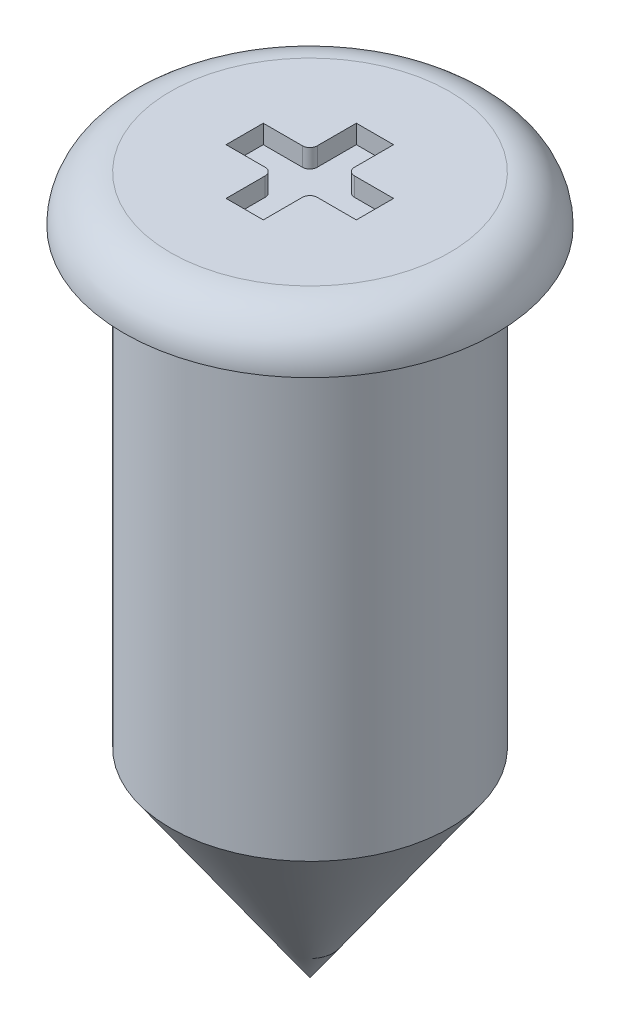
ISO-10303-21;
HEADER;
FILE_DESCRIPTION(('STEP AP214'),'2;1');
FILE_NAME('part.step','',(''),(''),'','','');
FILE_SCHEMA(('AUTOMOTIVE_DESIGN { 1 0 10303 214 1 1 1 1 }'));
ENDSEC;
DATA;
#1=APPLICATION_CONTEXT('core data for automotive mechanical design processes');
#2=APPLICATION_PROTOCOL_DEFINITION('international standard','automotive_design',2000,#1);
#3=PRODUCT_CONTEXT('',#1,'mechanical');
#4=PRODUCT('Part','Part','',(#3));
#5=PRODUCT_RELATED_PRODUCT_CATEGORY('part','',(#4));
#6=PRODUCT_DEFINITION_FORMATION('','',#4);
#7=PRODUCT_DEFINITION_CONTEXT('part definition',#1,'design');
#8=PRODUCT_DEFINITION('design','',#6,#7);
#9=PRODUCT_DEFINITION_SHAPE('','',#8);
#10=(LENGTH_UNIT() NAMED_UNIT(*) SI_UNIT(.MILLI.,.METRE.));
#11=(NAMED_UNIT(*) PLANE_ANGLE_UNIT() SI_UNIT($,.RADIAN.));
#12=(NAMED_UNIT(*) SI_UNIT($,.STERADIAN.) SOLID_ANGLE_UNIT());
#13=UNCERTAINTY_MEASURE_WITH_UNIT(LENGTH_MEASURE(1.E-05),#10,'distance_accuracy_value','');
#14=(GEOMETRIC_REPRESENTATION_CONTEXT(3) GLOBAL_UNCERTAINTY_ASSIGNED_CONTEXT((#13)) GLOBAL_UNIT_ASSIGNED_CONTEXT((#10,
#11,#12)) REPRESENTATION_CONTEXT('',''));
#15=CARTESIAN_POINT('',(0.,0.,0.));
#16=DIRECTION('',(0.,0.,1.));
#17=DIRECTION('',(1.,0.,0.));
#18=AXIS2_PLACEMENT_3D('',#15,#16,#17);
#19=CARTESIAN_POINT('',(0.,-14.4059764880595,0.));
#20=DIRECTION('',(0.,1.,0.));
#21=DIRECTION('',(0.,0.,1.));
#22=AXIS2_PLACEMENT_3D('',#19,#20,#21);
#23=CONICAL_SURFACE('',#22,0.,0.610177644580509);
#24=CARTESIAN_POINT('',(0.,-13.3332964313297,0.));
#25=DIRECTION('',(0.,1.,0.));
#26=DIRECTION('',(0.,0.,1.));
#27=AXIS2_PLACEMENT_3D('',#24,#25,#26);
#28=CIRCLE('',#27,0.75);
#29=CARTESIAN_POINT('',(0.,-13.3332964313297,0.75));
#30=VERTEX_POINT('',#29);
#31=EDGE_CURVE('E11',#30,#30,#28,.T.);
#32=ORIENTED_EDGE('',*,*,#31,.F.);
#33=EDGE_LOOP('',(#32));
#34=FACE_BOUND('',#33,.T.);
#35=CARTESIAN_POINT('',(0.,-14.4059764880595,0.));
#36=VERTEX_POINT('',#35);
#37=VERTEX_LOOP('',#36);
#38=FACE_BOUND('',#37,.T.);
#39=ADVANCED_FACE('F45',(#34,#38),#23,.T.);
#40=CARTESIAN_POINT('',(0.,-10.6559764880595,0.));
#41=DIRECTION('',(0.,1.,0.));
#42=DIRECTION('',(0.,0.,1.));
#43=AXIS2_PLACEMENT_3D('',#40,#41,#42);
#44=CYLINDRICAL_SURFACE('',#43,0.75);
#45=CARTESIAN_POINT('',(0.,-10.9059764880595,0.));
#46=DIRECTION('',(0.,1.,0.));
#47=DIRECTION('',(0.,0.,1.));
#48=AXIS2_PLACEMENT_3D('',#45,#46,#47);
#49=CIRCLE('',#48,0.75);
#50=CARTESIAN_POINT('',(0.,-10.9059764880595,0.75));
#51=VERTEX_POINT('',#50);
#52=EDGE_CURVE('E52',#51,#51,#49,.T.);
#53=ORIENTED_EDGE('',*,*,#52,.F.);
#54=EDGE_LOOP('',(#53));
#55=FACE_BOUND('',#54,.T.);
#56=ORIENTED_EDGE('',*,*,#31,.T.);
#57=EDGE_LOOP('',(#56));
#58=FACE_BOUND('',#57,.T.);
#59=ADVANCED_FACE('F301',(#55,#58),#44,.T.);
#60=CARTESIAN_POINT('',(0.75,-10.9059764880595,0.));
#61=DIRECTION('',(0.,1.,0.));
#62=DIRECTION('',(0.,0.,1.));
#63=AXIS2_PLACEMENT_3D('',#60,#61,#62);
#64=PLANE('',#63);
#65=CARTESIAN_POINT('',(0.,-10.9059764880595,0.));
#66=DIRECTION('',(0.,1.,0.));
#67=DIRECTION('',(0.,0.,1.));
#68=AXIS2_PLACEMENT_3D('',#65,#66,#67);
#69=CIRCLE('',#68,1.);
#70=CARTESIAN_POINT('',(0.,-10.9059764880595,1.));
#71=VERTEX_POINT('',#70);
#72=EDGE_CURVE('E294',#71,#71,#69,.T.);
#73=ORIENTED_EDGE('',*,*,#72,.F.);
#74=EDGE_LOOP('',(#73));
#75=FACE_BOUND('',#74,.T.);
#76=ORIENTED_EDGE('',*,*,#52,.T.);
#77=EDGE_LOOP('',(#76));
#78=FACE_BOUND('',#77,.T.);
#79=ADVANCED_FACE('F299',(#75,#78),#64,.F.);
#80=CARTESIAN_POINT('',(0.,-10.9059764880595,0.));
#81=DIRECTION('',(0.,1.,0.));
#82=DIRECTION('',(0.,0.,1.));
#83=AXIS2_PLACEMENT_3D('',#80,#81,#82);
#84=TOROIDAL_SURFACE('',#83,0.75,0.25);
#85=CARTESIAN_POINT('',(0.,-10.6559764880595,0.));
#86=DIRECTION('',(0.,1.,0.));
#87=DIRECTION('',(0.,0.,1.));
#88=AXIS2_PLACEMENT_3D('',#85,#86,#87);
#89=CIRCLE('',#88,0.75);
#90=CARTESIAN_POINT('',(0.,-10.6559764880595,0.75));
#91=VERTEX_POINT('',#90);
#92=EDGE_CURVE('E264',#91,#91,#89,.T.);
#93=ORIENTED_EDGE('',*,*,#92,.F.);
#94=EDGE_LOOP('',(#93));
#95=FACE_BOUND('',#94,.T.);
#96=ORIENTED_EDGE('',*,*,#72,.T.);
#97=EDGE_LOOP('',(#96));
#98=FACE_BOUND('',#97,.T.);
#99=ADVANCED_FACE('F320',(#95,#98),#84,.T.);
#100=CARTESIAN_POINT('',(0.75,-10.6559764880595,0.));
#101=DIRECTION('',(0.,-1.,0.));
#102=DIRECTION('',(0.,0.,-1.));
#103=AXIS2_PLACEMENT_3D('',#100,#101,#102);
#104=PLANE('',#103);
#105=DIRECTION('',(-1.,0.,0.));
#106=VECTOR('',#105,1.);
#107=CARTESIAN_POINT('',(-0.10270085440738,-10.6559764880595,-0.351707002554257));
#108=LINE('',#107,#106);
#109=CARTESIAN_POINT('',(0.0972991455926199,-10.6559764880595,-0.351707002554257));
#110=VERTEX_POINT('',#109);
#111=CARTESIAN_POINT('',(-0.10270085440738,-10.6559764880595,-0.351707002554257));
#112=VERTEX_POINT('',#111);
#113=EDGE_CURVE('E222',#110,#112,#108,.T.);
#114=ORIENTED_EDGE('',*,*,#113,.F.);
#115=DIRECTION('',(0.,0.,-1.));
#116=VECTOR('',#115,1.);
#117=CARTESIAN_POINT('',(0.0972991455926199,-10.6559764880595,-0.351707002554257));
#118=LINE('',#117,#116);
#119=CARTESIAN_POINT('',(0.0972991455926199,-10.6559764880595,-0.141707002554257));
#120=VERTEX_POINT('',#119);
#121=EDGE_CURVE('E59',#120,#110,#118,.T.);
#122=ORIENTED_EDGE('',*,*,#121,.F.);
#123=CARTESIAN_POINT('',(0.13729914559262,-10.6559764880595,-0.141707002554257));
#124=DIRECTION('',(0.,-1.,0.));
#125=DIRECTION('',(0.,0.,1.));
#126=AXIS2_PLACEMENT_3D('',#123,#124,#125);
#127=CIRCLE('',#126,0.04);
#128=CARTESIAN_POINT('',(0.13729914559262,-10.6559764880595,-0.101707002554257));
#129=VERTEX_POINT('',#128);
#130=EDGE_CURVE('E178',#129,#120,#127,.T.);
#131=ORIENTED_EDGE('',*,*,#130,.F.);
#132=DIRECTION('',(-1.,0.,0.));
#133=VECTOR('',#132,1.);
#134=CARTESIAN_POINT('',(0.13729914559262,-10.6559764880595,-0.101707002554257));
#135=LINE('',#134,#133);
#136=CARTESIAN_POINT('',(0.34729914559262,-10.6559764880595,-0.101707002554257));
#137=VERTEX_POINT('',#136);
#138=EDGE_CURVE('E181',#137,#129,#135,.T.);
#139=ORIENTED_EDGE('',*,*,#138,.F.);
#140=DIRECTION('',(0.,0.,-1.));
#141=VECTOR('',#140,1.);
#142=CARTESIAN_POINT('',(0.34729914559262,-10.6559764880595,-0.101707002554257));
#143=LINE('',#142,#141);
#144=CARTESIAN_POINT('',(0.34729914559262,-10.6559764880595,0.0982929974457434));
#145=VERTEX_POINT('',#144);
#146=EDGE_CURVE('E257',#145,#137,#143,.T.);
#147=ORIENTED_EDGE('',*,*,#146,.F.);
#148=DIRECTION('',(1.,0.,0.));
#149=VECTOR('',#148,1.);
#150=CARTESIAN_POINT('',(0.34729914559262,-10.6559764880595,0.0982929974457434));
#151=LINE('',#150,#149);
#152=CARTESIAN_POINT('',(0.13729914559262,-10.6559764880595,0.0982929974457434));
#153=VERTEX_POINT('',#152);
#154=EDGE_CURVE('E254',#153,#145,#151,.T.);
#155=ORIENTED_EDGE('',*,*,#154,.F.);
#156=CARTESIAN_POINT('',(0.13729914559262,-10.6559764880595,0.138292997445743));
#157=DIRECTION('',(0.,-1.,0.));
#158=DIRECTION('',(0.,0.,1.));
#159=AXIS2_PLACEMENT_3D('',#156,#157,#158);
#160=CIRCLE('',#159,0.04);
#161=CARTESIAN_POINT('',(0.09729914559262,-10.6559764880595,0.138292997445743));
#162=VERTEX_POINT('',#161);
#163=EDGE_CURVE('E251',#162,#153,#160,.T.);
#164=ORIENTED_EDGE('',*,*,#163,.F.);
#165=DIRECTION('',(0.,0.,-1.));
#166=VECTOR('',#165,1.);
#167=CARTESIAN_POINT('',(0.09729914559262,-10.6559764880595,0.138292997445743));
#168=LINE('',#167,#166);
#169=CARTESIAN_POINT('',(0.09729914559262,-10.6559764880595,0.348292997445743));
#170=VERTEX_POINT('',#169);
#171=EDGE_CURVE('E248',#170,#162,#168,.T.);
#172=ORIENTED_EDGE('',*,*,#171,.F.);
#173=DIRECTION('',(1.,0.,0.));
#174=VECTOR('',#173,1.);
#175=CARTESIAN_POINT('',(0.09729914559262,-10.6559764880595,0.348292997445743));
#176=LINE('',#175,#174);
#177=CARTESIAN_POINT('',(-0.10270085440738,-10.6559764880595,0.348292997445743));
#178=VERTEX_POINT('',#177);
#179=EDGE_CURVE('E245',#178,#170,#176,.T.);
#180=ORIENTED_EDGE('',*,*,#179,.F.);
#181=DIRECTION('',(0.,0.,1.));
#182=VECTOR('',#181,1.);
#183=CARTESIAN_POINT('',(-0.10270085440738,-10.6559764880595,0.138292997445743));
#184=LINE('',#183,#182);
#185=CARTESIAN_POINT('',(-0.10270085440738,-10.6559764880595,0.138292997445743));
#186=VERTEX_POINT('',#185);
#187=EDGE_CURVE('E242',#186,#178,#184,.T.);
#188=ORIENTED_EDGE('',*,*,#187,.F.);
#189=CARTESIAN_POINT('',(-0.14270085440738,-10.6559764880595,0.138292997445743));
#190=DIRECTION('',(0.,-1.,0.));
#191=DIRECTION('',(0.,0.,-1.));
#192=AXIS2_PLACEMENT_3D('',#189,#190,#191);
#193=CIRCLE('',#192,0.04);
#194=CARTESIAN_POINT('',(-0.14270085440738,-10.6559764880595,0.0982929974457434));
#195=VERTEX_POINT('',#194);
#196=EDGE_CURVE('E239',#195,#186,#193,.T.);
#197=ORIENTED_EDGE('',*,*,#196,.F.);
#198=DIRECTION('',(1.,0.,0.));
#199=VECTOR('',#198,1.);
#200=CARTESIAN_POINT('',(-0.35270085440738,-10.6559764880595,0.0982929974457434));
#201=LINE('',#200,#199);
#202=CARTESIAN_POINT('',(-0.35270085440738,-10.6559764880595,0.0982929974457434));
#203=VERTEX_POINT('',#202);
#204=EDGE_CURVE('E236',#203,#195,#201,.T.);
#205=ORIENTED_EDGE('',*,*,#204,.F.);
#206=DIRECTION('',(0.,0.,1.));
#207=VECTOR('',#206,1.);
#208=CARTESIAN_POINT('',(-0.35270085440738,-10.6559764880595,-0.101707002554257));
#209=LINE('',#208,#207);
#210=CARTESIAN_POINT('',(-0.35270085440738,-10.6559764880595,-0.101707002554257));
#211=VERTEX_POINT('',#210);
#212=EDGE_CURVE('E233',#211,#203,#209,.T.);
#213=ORIENTED_EDGE('',*,*,#212,.F.);
#214=DIRECTION('',(-1.,0.,0.));
#215=VECTOR('',#214,1.);
#216=CARTESIAN_POINT('',(-0.14270085440738,-10.6559764880595,-0.101707002554257));
#217=LINE('',#216,#215);
#218=CARTESIAN_POINT('',(-0.14270085440738,-10.6559764880595,-0.101707002554257));
#219=VERTEX_POINT('',#218);
#220=EDGE_CURVE('E230',#219,#211,#217,.T.);
#221=ORIENTED_EDGE('',*,*,#220,.F.);
#222=CARTESIAN_POINT('',(-0.14270085440738,-10.6559764880595,-0.141707002554257));
#223=DIRECTION('',(0.,-1.,0.));
#224=DIRECTION('',(0.,0.,-1.));
#225=AXIS2_PLACEMENT_3D('',#222,#223,#224);
#226=CIRCLE('',#225,0.04);
#227=CARTESIAN_POINT('',(-0.10270085440738,-10.6559764880595,-0.141707002554257));
#228=VERTEX_POINT('',#227);
#229=EDGE_CURVE('E227',#228,#219,#226,.T.);
#230=ORIENTED_EDGE('',*,*,#229,.F.);
#231=DIRECTION('',(0.,0.,1.));
#232=VECTOR('',#231,1.);
#233=CARTESIAN_POINT('',(-0.10270085440738,-10.6559764880595,-0.351707002554257));
#234=LINE('',#233,#232);
#235=EDGE_CURVE('E224',#112,#228,#234,.T.);
#236=ORIENTED_EDGE('',*,*,#235,.F.);
#237=EDGE_LOOP('',(#114,#122,#131,#139,#147,#155,#164,#172,#180,#188,#197,#205,#213,#221,#230,#236));
#238=FACE_BOUND('',#237,.T.);
#239=ORIENTED_EDGE('',*,*,#92,.T.);
#240=EDGE_LOOP('',(#239));
#241=FACE_BOUND('',#240,.T.);
#242=ADVANCED_FACE('F329',(#238,#241),#104,.F.);
#243=CARTESIAN_POINT('',(0.0972991455926199,-10.7559764880595,-0.351707002554257));
#244=DIRECTION('',(1.,0.,0.));
#245=DIRECTION('',(0.,0.,-1.));
#246=AXIS2_PLACEMENT_3D('',#243,#244,#245);
#247=PLANE('',#246);
#248=ORIENTED_EDGE('',*,*,#121,.T.);
#249=DIRECTION('',(0.,1.,0.));
#250=VECTOR('',#249,1.);
#251=CARTESIAN_POINT('',(0.0972991455926199,-10.7559764880595,-0.351707002554257));
#252=LINE('',#251,#250);
#253=CARTESIAN_POINT('',(0.0972991455926199,-10.7559764880595,-0.351707002554257));
#254=VERTEX_POINT('',#253);
#255=EDGE_CURVE('E155',#254,#110,#252,.T.);
#256=ORIENTED_EDGE('',*,*,#255,.F.);
#257=DIRECTION('',(0.,0.,-1.));
#258=VECTOR('',#257,1.);
#259=CARTESIAN_POINT('',(0.0972991455926199,-10.7559764880595,-0.351707002554257));
#260=LINE('',#259,#258);
#261=CARTESIAN_POINT('',(0.0972991455926199,-10.7559764880595,-0.141707002554257));
#262=VERTEX_POINT('',#261);
#263=EDGE_CURVE('E159',#262,#254,#260,.T.);
#264=ORIENTED_EDGE('',*,*,#263,.F.);
#265=DIRECTION('',(0.,1.,0.));
#266=VECTOR('',#265,1.);
#267=CARTESIAN_POINT('',(0.0972991455926199,-10.7559764880595,-0.141707002554257));
#268=LINE('',#267,#266);
#269=EDGE_CURVE('E262',#262,#120,#268,.T.);
#270=ORIENTED_EDGE('',*,*,#269,.T.);
#271=EDGE_LOOP('',(#248,#256,#264,#270));
#272=FACE_BOUND('',#271,.T.);
#273=ADVANCED_FACE('F157',(#272),#247,.F.);
#274=CARTESIAN_POINT('',(0.13729914559262,-10.7559764880595,-0.141707002554257));
#275=DIRECTION('',(0.,1.,0.));
#276=DIRECTION('',(0.,0.,1.));
#277=AXIS2_PLACEMENT_3D('',#274,#275,#276);
#278=CYLINDRICAL_SURFACE('',#277,0.04);
#279=ORIENTED_EDGE('',*,*,#130,.T.);
#280=ORIENTED_EDGE('',*,*,#269,.F.);
#281=CARTESIAN_POINT('',(0.13729914559262,-10.7559764880595,-0.141707002554257));
#282=DIRECTION('',(0.,-1.,0.));
#283=DIRECTION('',(0.,0.,1.));
#284=AXIS2_PLACEMENT_3D('',#281,#282,#283);
#285=CIRCLE('',#284,0.04);
#286=CARTESIAN_POINT('',(0.13729914559262,-10.7559764880595,-0.101707002554257));
#287=VERTEX_POINT('',#286);
#288=EDGE_CURVE('E165',#287,#262,#285,.T.);
#289=ORIENTED_EDGE('',*,*,#288,.F.);
#290=DIRECTION('',(0.,1.,0.));
#291=VECTOR('',#290,1.);
#292=CARTESIAN_POINT('',(0.13729914559262,-10.7559764880595,-0.101707002554257));
#293=LINE('',#292,#291);
#294=EDGE_CURVE('E265',#287,#129,#293,.T.);
#295=ORIENTED_EDGE('',*,*,#294,.T.);
#296=EDGE_LOOP('',(#279,#280,#289,#295));
#297=FACE_BOUND('',#296,.T.);
#298=ADVANCED_FACE('F344',(#297),#278,.T.);
#299=CARTESIAN_POINT('',(0.13729914559262,-10.7559764880595,-0.101707002554257));
#300=DIRECTION('',(0.,0.,-1.));
#301=DIRECTION('',(-1.,0.,0.));
#302=AXIS2_PLACEMENT_3D('',#299,#300,#301);
#303=PLANE('',#302);
#304=ORIENTED_EDGE('',*,*,#138,.T.);
#305=ORIENTED_EDGE('',*,*,#294,.F.);
#306=DIRECTION('',(-1.,0.,0.));
#307=VECTOR('',#306,1.);
#308=CARTESIAN_POINT('',(0.13729914559262,-10.7559764880595,-0.101707002554257));
#309=LINE('',#308,#307);
#310=CARTESIAN_POINT('',(0.34729914559262,-10.7559764880595,-0.101707002554257));
#311=VERTEX_POINT('',#310);
#312=EDGE_CURVE('E218',#311,#287,#309,.T.);
#313=ORIENTED_EDGE('',*,*,#312,.F.);
#314=DIRECTION('',(0.,1.,0.));
#315=VECTOR('',#314,1.);
#316=CARTESIAN_POINT('',(0.34729914559262,-10.7559764880595,-0.101707002554257));
#317=LINE('',#316,#315);
#318=EDGE_CURVE('E267',#311,#137,#317,.T.);
#319=ORIENTED_EDGE('',*,*,#318,.T.);
#320=EDGE_LOOP('',(#304,#305,#313,#319));
#321=FACE_BOUND('',#320,.T.);
#322=ADVANCED_FACE('F351',(#321),#303,.F.);
#323=CARTESIAN_POINT('',(0.34729914559262,-10.7559764880595,-0.101707002554257));
#324=DIRECTION('',(1.,0.,0.));
#325=DIRECTION('',(0.,0.,-1.));
#326=AXIS2_PLACEMENT_3D('',#323,#324,#325);
#327=PLANE('',#326);
#328=ORIENTED_EDGE('',*,*,#146,.T.);
#329=ORIENTED_EDGE('',*,*,#318,.F.);
#330=DIRECTION('',(0.,0.,-1.));
#331=VECTOR('',#330,1.);
#332=CARTESIAN_POINT('',(0.34729914559262,-10.7559764880595,-0.101707002554257));
#333=LINE('',#332,#331);
#334=CARTESIAN_POINT('',(0.34729914559262,-10.7559764880595,0.0982929974457434));
#335=VERTEX_POINT('',#334);
#336=EDGE_CURVE('E215',#335,#311,#333,.T.);
#337=ORIENTED_EDGE('',*,*,#336,.F.);
#338=DIRECTION('',(0.,1.,0.));
#339=VECTOR('',#338,1.);
#340=CARTESIAN_POINT('',(0.34729914559262,-10.7559764880595,0.0982929974457434));
#341=LINE('',#340,#339);
#342=EDGE_CURVE('E269',#335,#145,#341,.T.);
#343=ORIENTED_EDGE('',*,*,#342,.T.);
#344=EDGE_LOOP('',(#328,#329,#337,#343));
#345=FACE_BOUND('',#344,.T.);
#346=ADVANCED_FACE('F359',(#345),#327,.F.);
#347=CARTESIAN_POINT('',(0.34729914559262,-10.7559764880595,0.0982929974457434));
#348=DIRECTION('',(0.,0.,1.));
#349=DIRECTION('',(1.,0.,0.));
#350=AXIS2_PLACEMENT_3D('',#347,#348,#349);
#351=PLANE('',#350);
#352=ORIENTED_EDGE('',*,*,#154,.T.);
#353=ORIENTED_EDGE('',*,*,#342,.F.);
#354=DIRECTION('',(1.,0.,0.));
#355=VECTOR('',#354,1.);
#356=CARTESIAN_POINT('',(0.34729914559262,-10.7559764880595,0.0982929974457434));
#357=LINE('',#356,#355);
#358=CARTESIAN_POINT('',(0.13729914559262,-10.7559764880595,0.0982929974457434));
#359=VERTEX_POINT('',#358);
#360=EDGE_CURVE('E212',#359,#335,#357,.T.);
#361=ORIENTED_EDGE('',*,*,#360,.F.);
#362=DIRECTION('',(0.,1.,0.));
#363=VECTOR('',#362,1.);
#364=CARTESIAN_POINT('',(0.13729914559262,-10.7559764880595,0.0982929974457434));
#365=LINE('',#364,#363);
#366=EDGE_CURVE('E271',#359,#153,#365,.T.);
#367=ORIENTED_EDGE('',*,*,#366,.T.);
#368=EDGE_LOOP('',(#352,#353,#361,#367));
#369=FACE_BOUND('',#368,.T.);
#370=ADVANCED_FACE('F367',(#369),#351,.F.);
#371=CARTESIAN_POINT('',(0.13729914559262,-10.7559764880595,0.138292997445743));
#372=DIRECTION('',(0.,1.,0.));
#373=DIRECTION('',(0.,0.,1.));
#374=AXIS2_PLACEMENT_3D('',#371,#372,#373);
#375=CYLINDRICAL_SURFACE('',#374,0.04);
#376=ORIENTED_EDGE('',*,*,#163,.T.);
#377=ORIENTED_EDGE('',*,*,#366,.F.);
#378=CARTESIAN_POINT('',(0.13729914559262,-10.7559764880595,0.138292997445743));
#379=DIRECTION('',(0.,-1.,0.));
#380=DIRECTION('',(0.,0.,1.));
#381=AXIS2_PLACEMENT_3D('',#378,#379,#380);
#382=CIRCLE('',#381,0.04);
#383=CARTESIAN_POINT('',(0.09729914559262,-10.7559764880595,0.138292997445743));
#384=VERTEX_POINT('',#383);
#385=EDGE_CURVE('E209',#384,#359,#382,.T.);
#386=ORIENTED_EDGE('',*,*,#385,.F.);
#387=DIRECTION('',(0.,1.,0.));
#388=VECTOR('',#387,1.);
#389=CARTESIAN_POINT('',(0.09729914559262,-10.7559764880595,0.138292997445743));
#390=LINE('',#389,#388);
#391=EDGE_CURVE('E273',#384,#162,#390,.T.);
#392=ORIENTED_EDGE('',*,*,#391,.T.);
#393=EDGE_LOOP('',(#376,#377,#386,#392));
#394=FACE_BOUND('',#393,.T.);
#395=ADVANCED_FACE('F375',(#394),#375,.T.);
#396=CARTESIAN_POINT('',(0.09729914559262,-10.7559764880595,0.138292997445743));
#397=DIRECTION('',(1.,0.,0.));
#398=DIRECTION('',(0.,0.,-1.));
#399=AXIS2_PLACEMENT_3D('',#396,#397,#398);
#400=PLANE('',#399);
#401=ORIENTED_EDGE('',*,*,#171,.T.);
#402=ORIENTED_EDGE('',*,*,#391,.F.);
#403=DIRECTION('',(0.,0.,-1.));
#404=VECTOR('',#403,1.);
#405=CARTESIAN_POINT('',(0.09729914559262,-10.7559764880595,0.138292997445743));
#406=LINE('',#405,#404);
#407=CARTESIAN_POINT('',(0.09729914559262,-10.7559764880595,0.348292997445743));
#408=VERTEX_POINT('',#407);
#409=EDGE_CURVE('E206',#408,#384,#406,.T.);
#410=ORIENTED_EDGE('',*,*,#409,.F.);
#411=DIRECTION('',(0.,1.,0.));
#412=VECTOR('',#411,1.);
#413=CARTESIAN_POINT('',(0.09729914559262,-10.7559764880595,0.348292997445743));
#414=LINE('',#413,#412);
#415=EDGE_CURVE('E275',#408,#170,#414,.T.);
#416=ORIENTED_EDGE('',*,*,#415,.T.);
#417=EDGE_LOOP('',(#401,#402,#410,#416));
#418=FACE_BOUND('',#417,.T.);
#419=ADVANCED_FACE('F383',(#418),#400,.F.);
#420=CARTESIAN_POINT('',(0.09729914559262,-10.7559764880595,0.348292997445743));
#421=DIRECTION('',(0.,0.,1.));
#422=DIRECTION('',(1.,0.,0.));
#423=AXIS2_PLACEMENT_3D('',#420,#421,#422);
#424=PLANE('',#423);
#425=ORIENTED_EDGE('',*,*,#179,.T.);
#426=ORIENTED_EDGE('',*,*,#415,.F.);
#427=DIRECTION('',(1.,0.,0.));
#428=VECTOR('',#427,1.);
#429=CARTESIAN_POINT('',(0.09729914559262,-10.7559764880595,0.348292997445743));
#430=LINE('',#429,#428);
#431=CARTESIAN_POINT('',(-0.10270085440738,-10.7559764880595,0.348292997445743));
#432=VERTEX_POINT('',#431);
#433=EDGE_CURVE('E203',#432,#408,#430,.T.);
#434=ORIENTED_EDGE('',*,*,#433,.F.);
#435=DIRECTION('',(0.,1.,0.));
#436=VECTOR('',#435,1.);
#437=CARTESIAN_POINT('',(-0.10270085440738,-10.7559764880595,0.348292997445743));
#438=LINE('',#437,#436);
#439=EDGE_CURVE('E277',#432,#178,#438,.T.);
#440=ORIENTED_EDGE('',*,*,#439,.T.);
#441=EDGE_LOOP('',(#425,#426,#434,#440));
#442=FACE_BOUND('',#441,.T.);
#443=ADVANCED_FACE('F391',(#442),#424,.F.);
#444=CARTESIAN_POINT('',(-0.10270085440738,-10.7559764880595,0.138292997445743));
#445=DIRECTION('',(-1.,0.,0.));
#446=DIRECTION('',(0.,0.,1.));
#447=AXIS2_PLACEMENT_3D('',#444,#445,#446);
#448=PLANE('',#447);
#449=ORIENTED_EDGE('',*,*,#187,.T.);
#450=ORIENTED_EDGE('',*,*,#439,.F.);
#451=DIRECTION('',(0.,0.,1.));
#452=VECTOR('',#451,1.);
#453=CARTESIAN_POINT('',(-0.10270085440738,-10.7559764880595,0.138292997445743));
#454=LINE('',#453,#452);
#455=CARTESIAN_POINT('',(-0.10270085440738,-10.7559764880595,0.138292997445743));
#456=VERTEX_POINT('',#455);
#457=EDGE_CURVE('E200',#456,#432,#454,.T.);
#458=ORIENTED_EDGE('',*,*,#457,.F.);
#459=DIRECTION('',(0.,1.,0.));
#460=VECTOR('',#459,1.);
#461=CARTESIAN_POINT('',(-0.10270085440738,-10.7559764880595,0.138292997445743));
#462=LINE('',#461,#460);
#463=EDGE_CURVE('E279',#456,#186,#462,.T.);
#464=ORIENTED_EDGE('',*,*,#463,.T.);
#465=EDGE_LOOP('',(#449,#450,#458,#464));
#466=FACE_BOUND('',#465,.T.);
#467=ADVANCED_FACE('F399',(#466),#448,.F.);
#468=CARTESIAN_POINT('',(-0.14270085440738,-10.7559764880595,0.138292997445743));
#469=DIRECTION('',(0.,1.,0.));
#470=DIRECTION('',(0.,0.,1.));
#471=AXIS2_PLACEMENT_3D('',#468,#469,#470);
#472=CYLINDRICAL_SURFACE('',#471,0.04);
#473=ORIENTED_EDGE('',*,*,#196,.T.);
#474=ORIENTED_EDGE('',*,*,#463,.F.);
#475=CARTESIAN_POINT('',(-0.14270085440738,-10.7559764880595,0.138292997445743));
#476=DIRECTION('',(0.,-1.,0.));
#477=DIRECTION('',(0.,0.,-1.));
#478=AXIS2_PLACEMENT_3D('',#475,#476,#477);
#479=CIRCLE('',#478,0.04);
#480=CARTESIAN_POINT('',(-0.14270085440738,-10.7559764880595,0.0982929974457434));
#481=VERTEX_POINT('',#480);
#482=EDGE_CURVE('E197',#481,#456,#479,.T.);
#483=ORIENTED_EDGE('',*,*,#482,.F.);
#484=DIRECTION('',(0.,1.,0.));
#485=VECTOR('',#484,1.);
#486=CARTESIAN_POINT('',(-0.14270085440738,-10.7559764880595,0.0982929974457434));
#487=LINE('',#486,#485);
#488=EDGE_CURVE('E281',#481,#195,#487,.T.);
#489=ORIENTED_EDGE('',*,*,#488,.T.);
#490=EDGE_LOOP('',(#473,#474,#483,#489));
#491=FACE_BOUND('',#490,.T.);
#492=ADVANCED_FACE('F407',(#491),#472,.T.);
#493=CARTESIAN_POINT('',(-0.35270085440738,-10.7559764880595,0.0982929974457434));
#494=DIRECTION('',(0.,0.,1.));
#495=DIRECTION('',(1.,0.,0.));
#496=AXIS2_PLACEMENT_3D('',#493,#494,#495);
#497=PLANE('',#496);
#498=ORIENTED_EDGE('',*,*,#204,.T.);
#499=ORIENTED_EDGE('',*,*,#488,.F.);
#500=DIRECTION('',(1.,0.,0.));
#501=VECTOR('',#500,1.);
#502=CARTESIAN_POINT('',(-0.35270085440738,-10.7559764880595,0.0982929974457434));
#503=LINE('',#502,#501);
#504=CARTESIAN_POINT('',(-0.35270085440738,-10.7559764880595,0.0982929974457434));
#505=VERTEX_POINT('',#504);
#506=EDGE_CURVE('E194',#505,#481,#503,.T.);
#507=ORIENTED_EDGE('',*,*,#506,.F.);
#508=DIRECTION('',(0.,1.,0.));
#509=VECTOR('',#508,1.);
#510=CARTESIAN_POINT('',(-0.35270085440738,-10.7559764880595,0.0982929974457434));
#511=LINE('',#510,#509);
#512=EDGE_CURVE('E283',#505,#203,#511,.T.);
#513=ORIENTED_EDGE('',*,*,#512,.T.);
#514=EDGE_LOOP('',(#498,#499,#507,#513));
#515=FACE_BOUND('',#514,.T.);
#516=ADVANCED_FACE('F415',(#515),#497,.F.);
#517=CARTESIAN_POINT('',(-0.35270085440738,-10.7559764880595,-0.101707002554257));
#518=DIRECTION('',(-1.,0.,0.));
#519=DIRECTION('',(0.,0.,1.));
#520=AXIS2_PLACEMENT_3D('',#517,#518,#519);
#521=PLANE('',#520);
#522=ORIENTED_EDGE('',*,*,#212,.T.);
#523=ORIENTED_EDGE('',*,*,#512,.F.);
#524=DIRECTION('',(0.,0.,1.));
#525=VECTOR('',#524,1.);
#526=CARTESIAN_POINT('',(-0.35270085440738,-10.7559764880595,-0.101707002554257));
#527=LINE('',#526,#525);
#528=CARTESIAN_POINT('',(-0.35270085440738,-10.7559764880595,-0.101707002554257));
#529=VERTEX_POINT('',#528);
#530=EDGE_CURVE('E191',#529,#505,#527,.T.);
#531=ORIENTED_EDGE('',*,*,#530,.F.);
#532=DIRECTION('',(0.,1.,0.));
#533=VECTOR('',#532,1.);
#534=CARTESIAN_POINT('',(-0.35270085440738,-10.7559764880595,-0.101707002554257));
#535=LINE('',#534,#533);
#536=EDGE_CURVE('E285',#529,#211,#535,.T.);
#537=ORIENTED_EDGE('',*,*,#536,.T.);
#538=EDGE_LOOP('',(#522,#523,#531,#537));
#539=FACE_BOUND('',#538,.T.);
#540=ADVANCED_FACE('F423',(#539),#521,.F.);
#541=CARTESIAN_POINT('',(-0.14270085440738,-10.7559764880595,-0.101707002554257));
#542=DIRECTION('',(0.,0.,-1.));
#543=DIRECTION('',(-1.,0.,0.));
#544=AXIS2_PLACEMENT_3D('',#541,#542,#543);
#545=PLANE('',#544);
#546=ORIENTED_EDGE('',*,*,#220,.T.);
#547=ORIENTED_EDGE('',*,*,#536,.F.);
#548=DIRECTION('',(-1.,0.,0.));
#549=VECTOR('',#548,1.);
#550=CARTESIAN_POINT('',(-0.14270085440738,-10.7559764880595,-0.101707002554257));
#551=LINE('',#550,#549);
#552=CARTESIAN_POINT('',(-0.14270085440738,-10.7559764880595,-0.101707002554257));
#553=VERTEX_POINT('',#552);
#554=EDGE_CURVE('E188',#553,#529,#551,.T.);
#555=ORIENTED_EDGE('',*,*,#554,.F.);
#556=DIRECTION('',(0.,1.,0.));
#557=VECTOR('',#556,1.);
#558=CARTESIAN_POINT('',(-0.14270085440738,-10.7559764880595,-0.101707002554257));
#559=LINE('',#558,#557);
#560=EDGE_CURVE('E287',#553,#219,#559,.T.);
#561=ORIENTED_EDGE('',*,*,#560,.T.);
#562=EDGE_LOOP('',(#546,#547,#555,#561));
#563=FACE_BOUND('',#562,.T.);
#564=ADVANCED_FACE('F431',(#563),#545,.F.);
#565=CARTESIAN_POINT('',(-0.14270085440738,-10.7559764880595,-0.141707002554257));
#566=DIRECTION('',(0.,1.,0.));
#567=DIRECTION('',(0.,0.,1.));
#568=AXIS2_PLACEMENT_3D('',#565,#566,#567);
#569=CYLINDRICAL_SURFACE('',#568,0.04);
#570=ORIENTED_EDGE('',*,*,#229,.T.);
#571=ORIENTED_EDGE('',*,*,#560,.F.);
#572=CARTESIAN_POINT('',(-0.14270085440738,-10.7559764880595,-0.141707002554257));
#573=DIRECTION('',(0.,-1.,0.));
#574=DIRECTION('',(0.,0.,-1.));
#575=AXIS2_PLACEMENT_3D('',#572,#573,#574);
#576=CIRCLE('',#575,0.04);
#577=CARTESIAN_POINT('',(-0.10270085440738,-10.7559764880595,-0.141707002554257));
#578=VERTEX_POINT('',#577);
#579=EDGE_CURVE('E185',#578,#553,#576,.T.);
#580=ORIENTED_EDGE('',*,*,#579,.F.);
#581=DIRECTION('',(0.,1.,0.));
#582=VECTOR('',#581,1.);
#583=CARTESIAN_POINT('',(-0.10270085440738,-10.7559764880595,-0.141707002554257));
#584=LINE('',#583,#582);
#585=EDGE_CURVE('E289',#578,#228,#584,.T.);
#586=ORIENTED_EDGE('',*,*,#585,.T.);
#587=EDGE_LOOP('',(#570,#571,#580,#586));
#588=FACE_BOUND('',#587,.T.);
#589=ADVANCED_FACE('F439',(#588),#569,.T.);
#590=CARTESIAN_POINT('',(-0.10270085440738,-10.7559764880595,-0.351707002554257));
#591=DIRECTION('',(-1.,0.,0.));
#592=DIRECTION('',(0.,0.,1.));
#593=AXIS2_PLACEMENT_3D('',#590,#591,#592);
#594=PLANE('',#593);
#595=ORIENTED_EDGE('',*,*,#235,.T.);
#596=ORIENTED_EDGE('',*,*,#585,.F.);
#597=DIRECTION('',(0.,0.,1.));
#598=VECTOR('',#597,1.);
#599=CARTESIAN_POINT('',(-0.10270085440738,-10.7559764880595,-0.351707002554257));
#600=LINE('',#599,#598);
#601=CARTESIAN_POINT('',(-0.10270085440738,-10.7559764880595,-0.351707002554257));
#602=VERTEX_POINT('',#601);
#603=EDGE_CURVE('E173',#602,#578,#600,.T.);
#604=ORIENTED_EDGE('',*,*,#603,.F.);
#605=DIRECTION('',(0.,1.,0.));
#606=VECTOR('',#605,1.);
#607=CARTESIAN_POINT('',(-0.10270085440738,-10.7559764880595,-0.351707002554257));
#608=LINE('',#607,#606);
#609=EDGE_CURVE('E164',#602,#112,#608,.T.);
#610=ORIENTED_EDGE('',*,*,#609,.T.);
#611=EDGE_LOOP('',(#595,#596,#604,#610));
#612=FACE_BOUND('',#611,.T.);
#613=ADVANCED_FACE('F447',(#612),#594,.F.);
#614=CARTESIAN_POINT('',(-0.10270085440738,-10.7559764880595,-0.351707002554257));
#615=DIRECTION('',(0.,0.,-1.));
#616=DIRECTION('',(-1.,0.,0.));
#617=AXIS2_PLACEMENT_3D('',#614,#615,#616);
#618=PLANE('',#617);
#619=ORIENTED_EDGE('',*,*,#113,.T.);
#620=ORIENTED_EDGE('',*,*,#609,.F.);
#621=DIRECTION('',(-1.,0.,0.));
#622=VECTOR('',#621,1.);
#623=CARTESIAN_POINT('',(-0.10270085440738,-10.7559764880595,-0.351707002554257));
#624=LINE('',#623,#622);
#625=EDGE_CURVE('E168',#254,#602,#624,.T.);
#626=ORIENTED_EDGE('',*,*,#625,.F.);
#627=ORIENTED_EDGE('',*,*,#255,.T.);
#628=EDGE_LOOP('',(#619,#620,#626,#627));
#629=FACE_BOUND('',#628,.T.);
#630=ADVANCED_FACE('F169',(#629),#618,.F.);
#631=CARTESIAN_POINT('',(0.13729914559262,-10.7559764880595,-0.141707002554257));
#632=DIRECTION('',(0.,1.,0.));
#633=DIRECTION('',(0.,0.,1.));
#634=AXIS2_PLACEMENT_3D('',#631,#632,#633);
#635=PLANE('',#634);
#636=ORIENTED_EDGE('',*,*,#263,.T.);
#637=ORIENTED_EDGE('',*,*,#625,.T.);
#638=ORIENTED_EDGE('',*,*,#603,.T.);
#639=ORIENTED_EDGE('',*,*,#579,.T.);
#640=ORIENTED_EDGE('',*,*,#554,.T.);
#641=ORIENTED_EDGE('',*,*,#530,.T.);
#642=ORIENTED_EDGE('',*,*,#506,.T.);
#643=ORIENTED_EDGE('',*,*,#482,.T.);
#644=ORIENTED_EDGE('',*,*,#457,.T.);
#645=ORIENTED_EDGE('',*,*,#433,.T.);
#646=ORIENTED_EDGE('',*,*,#409,.T.);
#647=ORIENTED_EDGE('',*,*,#385,.T.);
#648=ORIENTED_EDGE('',*,*,#360,.T.);
#649=ORIENTED_EDGE('',*,*,#336,.T.);
#650=ORIENTED_EDGE('',*,*,#312,.T.);
#651=ORIENTED_EDGE('',*,*,#288,.T.);
#652=EDGE_LOOP('',(#636,#637,#638,#639,#640,#641,#642,#643,#644,#645,#646,#647,#648,#649,#650,#651));
#653=FACE_BOUND('',#652,.T.);
#654=ADVANCED_FACE('F175',(#653),#635,.T.);
#655=CLOSED_SHELL('',(#39,#59,#79,#99,#242,#273,#298,#322,#346,#370,#395,#419,#443,#467,#492,
#516,#540,#564,#589,#613,#630,#654));
#656=MANIFOLD_SOLID_BREP('B2',#655);
#657=ADVANCED_BREP_SHAPE_REPRESENTATION('',(#18,#656),#14);
#658=SHAPE_DEFINITION_REPRESENTATION(#9,#657);
ENDSEC;
END-ISO-10303-21;
